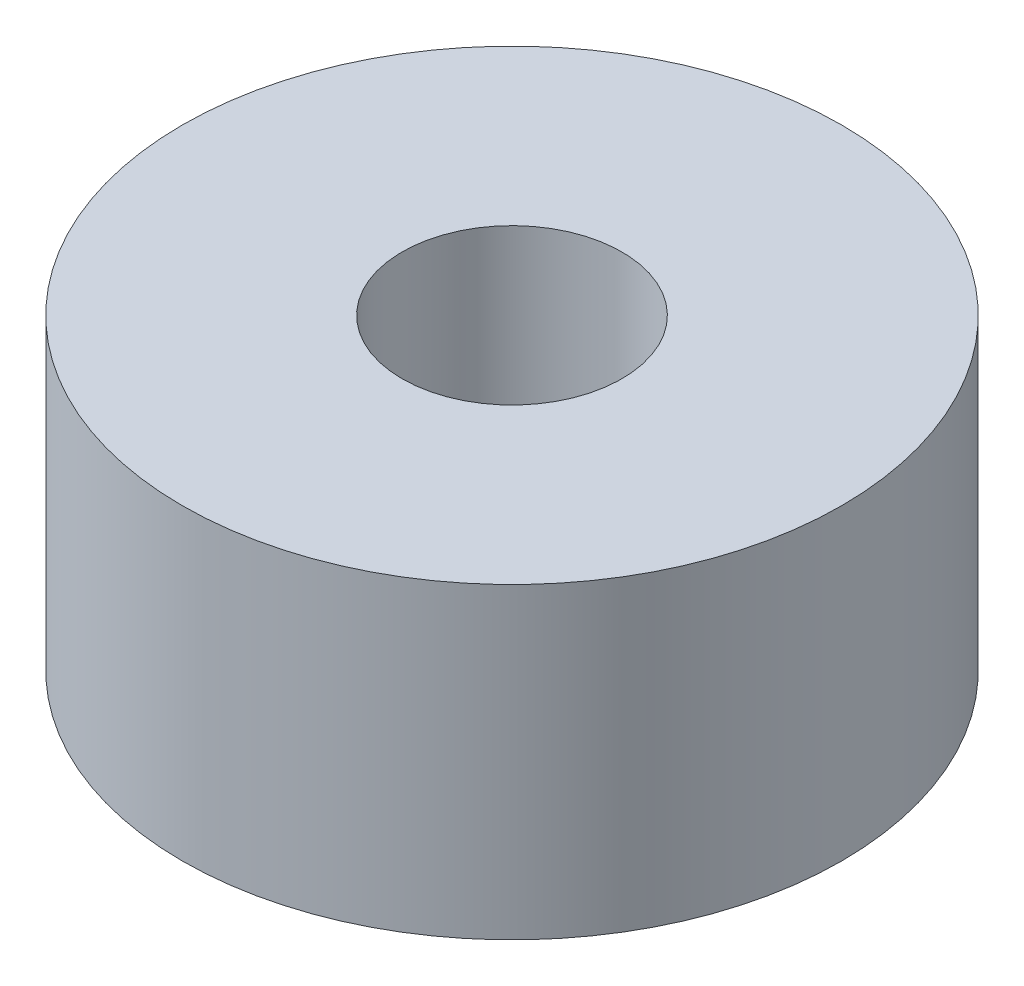
ISO-10303-21;
HEADER;
FILE_DESCRIPTION(('STEP AP214'),'2;1');
FILE_NAME('part.step','',(''),(''),'','','');
FILE_SCHEMA(('AUTOMOTIVE_DESIGN { 1 0 10303 214 1 1 1 1 }'));
ENDSEC;
DATA;
#1=APPLICATION_CONTEXT('core data for automotive mechanical design processes');
#2=APPLICATION_PROTOCOL_DEFINITION('international standard','automotive_design',2000,#1);
#3=PRODUCT_CONTEXT('',#1,'mechanical');
#4=PRODUCT('Part','Part','',(#3));
#5=PRODUCT_RELATED_PRODUCT_CATEGORY('part','',(#4));
#6=PRODUCT_DEFINITION_FORMATION('','',#4);
#7=PRODUCT_DEFINITION_CONTEXT('part definition',#1,'design');
#8=PRODUCT_DEFINITION('design','',#6,#7);
#9=PRODUCT_DEFINITION_SHAPE('','',#8);
#10=(LENGTH_UNIT() NAMED_UNIT(*) SI_UNIT(.MILLI.,.METRE.));
#11=(NAMED_UNIT(*) PLANE_ANGLE_UNIT() SI_UNIT($,.RADIAN.));
#12=(NAMED_UNIT(*) SI_UNIT($,.STERADIAN.) SOLID_ANGLE_UNIT());
#13=UNCERTAINTY_MEASURE_WITH_UNIT(LENGTH_MEASURE(1.E-05),#10,'distance_accuracy_value','');
#14=(GEOMETRIC_REPRESENTATION_CONTEXT(3) GLOBAL_UNCERTAINTY_ASSIGNED_CONTEXT((#13)) GLOBAL_UNIT_ASSIGNED_CONTEXT((#10,
#11,#12)) REPRESENTATION_CONTEXT('',''));
#15=CARTESIAN_POINT('',(0.,0.,0.));
#16=DIRECTION('',(0.,0.,1.));
#17=DIRECTION('',(1.,0.,0.));
#18=AXIS2_PLACEMENT_3D('',#15,#16,#17);
#19=CARTESIAN_POINT('',(0.,14.,0.));
#20=DIRECTION('',(0.,1.,0.));
#21=DIRECTION('',(0.,0.,1.));
#22=AXIS2_PLACEMENT_3D('',#19,#20,#21);
#23=PLANE('',#22);
#24=CARTESIAN_POINT('',(0.,14.,0.));
#25=DIRECTION('',(0.,1.,0.));
#26=DIRECTION('',(0.,0.,1.));
#27=AXIS2_PLACEMENT_3D('',#24,#25,#26);
#28=CIRCLE('',#27,15.);
#29=CARTESIAN_POINT('',(0.,14.,15.));
#30=VERTEX_POINT('',#29);
#31=EDGE_CURVE('E10',#30,#30,#28,.T.);
#32=ORIENTED_EDGE('',*,*,#31,.T.);
#33=EDGE_LOOP('',(#32));
#34=FACE_BOUND('',#33,.T.);
#35=CARTESIAN_POINT('',(0.,14.,0.));
#36=DIRECTION('',(0.,1.,0.));
#37=DIRECTION('',(0.,0.,1.));
#38=AXIS2_PLACEMENT_3D('',#35,#36,#37);
#39=CIRCLE('',#38,5.);
#40=CARTESIAN_POINT('',(0.,14.,5.));
#41=VERTEX_POINT('',#40);
#42=EDGE_CURVE('E42',#41,#41,#39,.T.);
#43=ORIENTED_EDGE('',*,*,#42,.F.);
#44=EDGE_LOOP('',(#43));
#45=FACE_BOUND('',#44,.T.);
#46=ADVANCED_FACE('F31',(#34,#45),#23,.T.);
#47=CARTESIAN_POINT('',(0.,0.,0.));
#48=DIRECTION('',(0.,1.,0.));
#49=DIRECTION('',(0.,0.,1.));
#50=AXIS2_PLACEMENT_3D('',#47,#48,#49);
#51=PLANE('',#50);
#52=CARTESIAN_POINT('',(0.,0.,0.));
#53=DIRECTION('',(0.,1.,0.));
#54=DIRECTION('',(0.,0.,1.));
#55=AXIS2_PLACEMENT_3D('',#52,#53,#54);
#56=CIRCLE('',#55,15.);
#57=CARTESIAN_POINT('',(0.,0.,15.));
#58=VERTEX_POINT('',#57);
#59=EDGE_CURVE('E35',#58,#58,#56,.T.);
#60=ORIENTED_EDGE('',*,*,#59,.F.);
#61=EDGE_LOOP('',(#60));
#62=FACE_BOUND('',#61,.T.);
#63=CARTESIAN_POINT('',(0.,0.,0.));
#64=DIRECTION('',(0.,1.,0.));
#65=DIRECTION('',(0.,0.,1.));
#66=AXIS2_PLACEMENT_3D('',#63,#64,#65);
#67=CIRCLE('',#66,5.);
#68=CARTESIAN_POINT('',(0.,0.,5.));
#69=VERTEX_POINT('',#68);
#70=EDGE_CURVE('E44',#69,#69,#67,.T.);
#71=ORIENTED_EDGE('',*,*,#70,.T.);
#72=EDGE_LOOP('',(#71));
#73=FACE_BOUND('',#72,.T.);
#74=ADVANCED_FACE('F54',(#62,#73),#51,.F.);
#75=CARTESIAN_POINT('',(0.,14.,0.));
#76=DIRECTION('',(0.,-1.,0.));
#77=DIRECTION('',(0.,0.,-1.));
#78=AXIS2_PLACEMENT_3D('',#75,#76,#77);
#79=CYLINDRICAL_SURFACE('',#78,15.);
#80=ORIENTED_EDGE('',*,*,#31,.F.);
#81=EDGE_LOOP('',(#80));
#82=FACE_BOUND('',#81,.T.);
#83=ORIENTED_EDGE('',*,*,#59,.T.);
#84=EDGE_LOOP('',(#83));
#85=FACE_BOUND('',#84,.T.);
#86=ADVANCED_FACE('F33',(#82,#85),#79,.T.);
#87=CARTESIAN_POINT('',(0.,14.,0.));
#88=DIRECTION('',(0.,-1.,0.));
#89=DIRECTION('',(0.,0.,-1.));
#90=AXIS2_PLACEMENT_3D('',#87,#88,#89);
#91=CYLINDRICAL_SURFACE('',#90,5.);
#92=ORIENTED_EDGE('',*,*,#42,.T.);
#93=EDGE_LOOP('',(#92));
#94=FACE_BOUND('',#93,.T.);
#95=ORIENTED_EDGE('',*,*,#70,.F.);
#96=EDGE_LOOP('',(#95));
#97=FACE_BOUND('',#96,.T.);
#98=ADVANCED_FACE('F50',(#94,#97),#91,.F.);
#99=CLOSED_SHELL('',(#46,#74,#86,#98));
#100=MANIFOLD_SOLID_BREP('B2',#99);
#101=ADVANCED_BREP_SHAPE_REPRESENTATION('',(#18,#100),#14);
#102=SHAPE_DEFINITION_REPRESENTATION(#9,#101);
ENDSEC;
END-ISO-10303-21;
